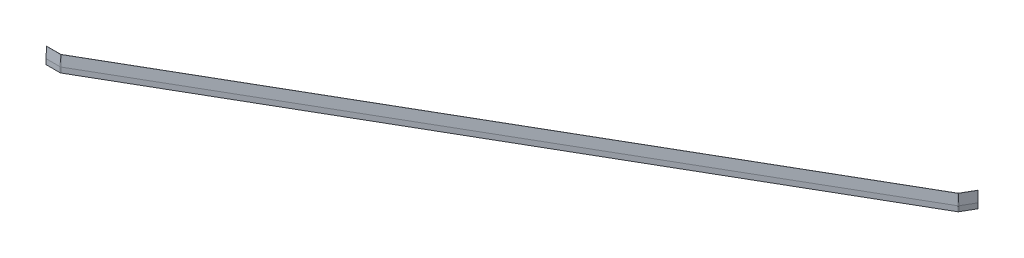
ISO-10303-21;
HEADER;
FILE_DESCRIPTION(('STEP AP214'),'2;1');
FILE_NAME('part.step','',(''),(''),'','','');
FILE_SCHEMA(('AUTOMOTIVE_DESIGN { 1 0 10303 214 1 1 1 1 }'));
ENDSEC;
DATA;
#1=APPLICATION_CONTEXT('core data for automotive mechanical design processes');
#2=APPLICATION_PROTOCOL_DEFINITION('international standard','automotive_design',2000,#1);
#3=PRODUCT_CONTEXT('',#1,'mechanical');
#4=PRODUCT('Part','Part','',(#3));
#5=PRODUCT_RELATED_PRODUCT_CATEGORY('part','',(#4));
#6=PRODUCT_DEFINITION_FORMATION('','',#4);
#7=PRODUCT_DEFINITION_CONTEXT('part definition',#1,'design');
#8=PRODUCT_DEFINITION('design','',#6,#7);
#9=PRODUCT_DEFINITION_SHAPE('','',#8);
#10=(LENGTH_UNIT() NAMED_UNIT(*) SI_UNIT(.MILLI.,.METRE.));
#11=(NAMED_UNIT(*) PLANE_ANGLE_UNIT() SI_UNIT($,.RADIAN.));
#12=(NAMED_UNIT(*) SI_UNIT($,.STERADIAN.) SOLID_ANGLE_UNIT());
#13=UNCERTAINTY_MEASURE_WITH_UNIT(LENGTH_MEASURE(1.E-05),#10,'distance_accuracy_value','');
#14=(GEOMETRIC_REPRESENTATION_CONTEXT(3) GLOBAL_UNCERTAINTY_ASSIGNED_CONTEXT((#13)) GLOBAL_UNIT_ASSIGNED_CONTEXT((#10,
#11,#12)) REPRESENTATION_CONTEXT('',''));
#15=CARTESIAN_POINT('',(0.,0.,0.));
#16=DIRECTION('',(0.,0.,1.));
#17=DIRECTION('',(1.,0.,0.));
#18=AXIS2_PLACEMENT_3D('',#15,#16,#17);
#19=CARTESIAN_POINT('',(969.539186434532,-29.9999999999976,-1289.67239500882));
#20=DIRECTION('',(0.500000000000001,0.,0.866025403784438));
#21=DIRECTION('',(0.866025403784438,0.,-0.500000000000001));
#22=AXIS2_PLACEMENT_3D('',#19,#20,#21);
#23=PLANE('',#22);
#24=DIRECTION('',(-0.866025403784438,0.,0.500000000000001));
#25=VECTOR('',#24,1.);
#26=CARTESIAN_POINT('',(969.539186434532,-29.9999999999976,-1289.67239500882));
#27=LINE('',#26,#25);
#28=CARTESIAN_POINT('',(920.944208314139,-29.9999999999977,-1261.61607130975));
#29=VERTEX_POINT('',#28);
#30=CARTESIAN_POINT('',(-1259.51264739815,-30.0000000000002,-2.72871870788949));
#31=VERTEX_POINT('',#30);
#32=EDGE_CURVE('E553',#29,#31,#27,.T.);
#33=ORIENTED_EDGE('',*,*,#32,.T.);
#34=CARTESIAN_POINT('',(-1259.51264739815,-30.0000000000002,-2.72871870788949));
#35=CARTESIAN_POINT('',(-1259.51264739815,-15.5000000000002,-2.72871870788949));
#36=B_SPLINE_CURVE_WITH_KNOTS('',1,(#34,#35),.UNSPECIFIED.,.F.,.F.,(2,2),(0.,1.),.UNSPECIFIED.);
#37=CARTESIAN_POINT('',(-1259.51264739815,-15.5000000000002,-2.72871870788949));
#38=VERTEX_POINT('',#37);
#39=EDGE_CURVE('E525',#31,#38,#36,.T.);
#40=ORIENTED_EDGE('',*,*,#39,.T.);
#41=DIRECTION('',(-0.866025403784438,0.,0.500000000000001));
#42=VECTOR('',#41,1.);
#43=CARTESIAN_POINT('',(969.539186434532,-15.4999999999976,-1289.67239500882));
#44=LINE('',#43,#42);
#45=CARTESIAN_POINT('',(920.944208314139,-15.4999999999977,-1261.61607130975));
#46=VERTEX_POINT('',#45);
#47=EDGE_CURVE('E557',#46,#38,#44,.T.);
#48=ORIENTED_EDGE('',*,*,#47,.F.);
#49=CARTESIAN_POINT('',(920.944208314139,-29.9999999999977,-1261.61607130975));
#50=CARTESIAN_POINT('',(920.944208314139,-15.4999999999977,-1261.61607130975));
#51=B_SPLINE_CURVE_WITH_KNOTS('',1,(#49,#50),.UNSPECIFIED.,.F.,.F.,(2,2),(0.,1.),.UNSPECIFIED.);
#52=EDGE_CURVE('E655',#29,#46,#51,.T.);
#53=ORIENTED_EDGE('',*,*,#52,.F.);
#54=EDGE_LOOP('',(#33,#40,#48,#53));
#55=FACE_BOUND('',#54,.T.);
#56=ADVANCED_FACE('F167',(#55),#23,.F.);
#57=CARTESIAN_POINT('',(969.439186434532,-15.4999999999976,-1289.84560008958));
#58=DIRECTION('',(0.,1.,0.));
#59=DIRECTION('',(-0.866025403784438,0.,0.500000000000001));
#60=AXIS2_PLACEMENT_3D('',#57,#58,#59);
#61=PLANE('',#60);
#62=ORIENTED_EDGE('',*,*,#47,.T.);
#63=CARTESIAN_POINT('',(-1259.51264739815,-15.5000000000002,-2.72871870788949));
#64=CARTESIAN_POINT('',(-1259.61264739815,-15.5000000000002,-2.9019237886464));
#65=B_SPLINE_CURVE_WITH_KNOTS('',1,(#63,#64),.UNSPECIFIED.,.F.,.F.,(2,2),(0.,1.),.UNSPECIFIED.);
#66=CARTESIAN_POINT('',(-1259.61264739815,-15.5000000000002,-2.9019237886464));
#67=VERTEX_POINT('',#66);
#68=EDGE_CURVE('E528',#38,#67,#65,.T.);
#69=ORIENTED_EDGE('',*,*,#68,.T.);
#70=DIRECTION('',(-0.866025403784438,0.,0.500000000000001));
#71=VECTOR('',#70,1.);
#72=CARTESIAN_POINT('',(969.439186434532,-15.4999999999976,-1289.84560008958));
#73=LINE('',#72,#71);
#74=CARTESIAN_POINT('',(920.844208314139,-15.4999999999977,-1261.7892763905));
#75=VERTEX_POINT('',#74);
#76=EDGE_CURVE('E563',#75,#67,#73,.T.);
#77=ORIENTED_EDGE('',*,*,#76,.F.);
#78=CARTESIAN_POINT('',(920.944208314139,-15.4999999999977,-1261.61607130975));
#79=CARTESIAN_POINT('',(920.844208314139,-15.4999999999977,-1261.7892763905));
#80=B_SPLINE_CURVE_WITH_KNOTS('',1,(#78,#79),.UNSPECIFIED.,.F.,.F.,(2,2),(0.,1.),.UNSPECIFIED.);
#81=EDGE_CURVE('E659',#46,#75,#80,.T.);
#82=ORIENTED_EDGE('',*,*,#81,.F.);
#83=EDGE_LOOP('',(#62,#69,#77,#82));
#84=FACE_BOUND('',#83,.T.);
#85=ADVANCED_FACE('F626',(#84),#61,.F.);
#86=CARTESIAN_POINT('',(969.439186434532,30.0000000000027,-1289.84560008958));
#87=DIRECTION('',(0.,1.,0.));
#88=DIRECTION('',(-0.866025403784438,0.,0.500000000000001));
#89=AXIS2_PLACEMENT_3D('',#86,#87,#88);
#90=PLANE('',#89);
#91=DIRECTION('',(-0.866025403784438,0.,0.500000000000001));
#92=VECTOR('',#91,1.);
#93=CARTESIAN_POINT('',(969.589186434532,30.0000000000024,-1289.58579246844));
#94=LINE('',#93,#92);
#95=CARTESIAN_POINT('',(920.994208314139,30.0000000000027,-1261.52946876937));
#96=VERTEX_POINT('',#95);
#97=CARTESIAN_POINT('',(-1259.46264739815,29.9999999999998,-2.64211616751131));
#98=VERTEX_POINT('',#97);
#99=EDGE_CURVE('E184',#96,#98,#94,.T.);
#100=ORIENTED_EDGE('',*,*,#99,.F.);
#101=CARTESIAN_POINT('',(920.994208314139,30.0000000000027,-1261.52946876937));
#102=DIRECTION('',(-0.499999999999989,0.,-0.866025403784445));
#103=VECTOR('',#102,1.);
#104=LINE('',#101,#103);
#105=CARTESIAN_POINT('',(920.844208314139,30.0000000000027,-1261.7892763905));
#106=VERTEX_POINT('',#105);
#107=EDGE_CURVE('E974',#96,#106,#104,.T.);
#108=ORIENTED_EDGE('',*,*,#107,.T.);
#109=DIRECTION('',(-0.866025403784438,0.,0.500000000000001));
#110=VECTOR('',#109,1.);
#111=CARTESIAN_POINT('',(969.439186434532,30.0000000000027,-1289.84560008958));
#112=LINE('',#111,#110);
#113=CARTESIAN_POINT('',(-1259.61264739815,29.9999999999998,-2.90192378864628));
#114=VERTEX_POINT('',#113);
#115=EDGE_CURVE('E565',#106,#114,#112,.T.);
#116=ORIENTED_EDGE('',*,*,#115,.T.);
#117=CARTESIAN_POINT('',(-1259.46264739815,29.9999999999998,-2.64211616751125));
#118=DIRECTION('',(-0.500000000000269,0.,-0.866025403784284));
#119=VECTOR('',#118,1.);
#120=LINE('',#117,#119);
#121=EDGE_CURVE('E13',#98,#114,#120,.T.);
#122=ORIENTED_EDGE('',*,*,#121,.F.);
#123=EDGE_LOOP('',(#100,#108,#116,#122));
#124=FACE_BOUND('',#123,.T.);
#125=ADVANCED_FACE('F587',(#124),#90,.T.);
#126=CARTESIAN_POINT('',(-168.134219542004,1.24553145575135E-12,-630.180536580114));
#127=DIRECTION('',(0.500000000000001,0.,0.866025403784438));
#128=DIRECTION('',(0.866025403784438,0.,-0.500000000000001));
#129=AXIS2_PLACEMENT_3D('',#126,#127,#128);
#130=PLANE('',#129);
#131=DIRECTION('',(0.866025403784438,0.,-0.500000000000001));
#132=VECTOR('',#131,1.);
#133=CARTESIAN_POINT('',(970.689186434532,-29.9999999999973,-1287.68053658011));
#134=LINE('',#133,#132);
#135=CARTESIAN_POINT('',(-1258.36264739815,-30.0000000000002,-0.736860279185736));
#136=VERTEX_POINT('',#135);
#137=CARTESIAN_POINT('',(922.094208314139,-29.9999999999973,-1259.62421288104));
#138=VERTEX_POINT('',#137);
#139=EDGE_CURVE('E600',#136,#138,#134,.T.);
#140=ORIENTED_EDGE('',*,*,#139,.T.);
#141=CARTESIAN_POINT('',(922.094208314139,-9.99999999999754,-1259.62421288104));
#142=DIRECTION('',(0.,-1.,0.));
#143=VECTOR('',#142,1.);
#144=LINE('',#141,#143);
#145=CARTESIAN_POINT('',(922.094208314139,-9.99999999999767,-1259.62421288104));
#146=VERTEX_POINT('',#145);
#147=EDGE_CURVE('E986',#146,#138,#144,.T.);
#148=ORIENTED_EDGE('',*,*,#147,.F.);
#149=DIRECTION('',(-0.866025403784438,0.,0.500000000000001));
#150=VECTOR('',#149,1.);
#151=CARTESIAN_POINT('',(970.689186434532,-9.99999999999762,-1287.68053658011));
#152=LINE('',#151,#150);
#153=CARTESIAN_POINT('',(-1258.36264739815,-10.0000000000002,-0.736860279185625));
#154=VERTEX_POINT('',#153);
#155=EDGE_CURVE('E192',#146,#154,#152,.T.);
#156=ORIENTED_EDGE('',*,*,#155,.T.);
#157=CARTESIAN_POINT('',(-1258.36264739815,-30.0000000000002,-0.736860279185858));
#158=DIRECTION('',(0.,1.,0.));
#159=VECTOR('',#158,1.);
#160=LINE('',#157,#159);
#161=EDGE_CURVE('E517',#136,#154,#160,.T.);
#162=ORIENTED_EDGE('',*,*,#161,.F.);
#163=EDGE_LOOP('',(#140,#148,#156,#162));
#164=FACE_BOUND('',#163,.T.);
#165=ADVANCED_FACE('F590',(#164),#130,.T.);
#166=CARTESIAN_POINT('',(969.439186434532,-29.9999999999973,-1289.84560008958));
#167=DIRECTION('',(0.,-1.,0.));
#168=DIRECTION('',(0.866025403784438,0.,-0.500000000000001));
#169=AXIS2_PLACEMENT_3D('',#166,#167,#168);
#170=PLANE('',#169);
#171=ORIENTED_EDGE('',*,*,#32,.F.);
#172=CARTESIAN_POINT('',(920.944208314139,-29.9999999999973,-1261.61607130975));
#173=DIRECTION('',(0.500000000000003,0.,0.866025403784437));
#174=VECTOR('',#173,1.);
#175=LINE('',#172,#174);
#176=EDGE_CURVE('E653',#29,#138,#175,.T.);
#177=ORIENTED_EDGE('',*,*,#176,.T.);
#178=ORIENTED_EDGE('',*,*,#139,.F.);
#179=CARTESIAN_POINT('',(-1259.51264739815,-30.0000000000002,-2.72871870788963));
#180=DIRECTION('',(0.500000000000199,0.,0.866025403784324));
#181=VECTOR('',#180,1.);
#182=LINE('',#179,#181);
#183=EDGE_CURVE('E452',#31,#136,#182,.T.);
#184=ORIENTED_EDGE('',*,*,#183,.F.);
#185=EDGE_LOOP('',(#171,#177,#178,#184));
#186=FACE_BOUND('',#185,.T.);
#187=ADVANCED_FACE('F617',(#186),#170,.T.);
#188=CARTESIAN_POINT('',(-169.384219542004,1.25478291714624E-12,-632.345600089575));
#189=DIRECTION('',(0.500000000000001,0.,0.866025403784438));
#190=DIRECTION('',(0.866025403784438,0.,-0.500000000000001));
#191=AXIS2_PLACEMENT_3D('',#188,#189,#190);
#192=PLANE('',#191);
#193=CARTESIAN_POINT('',(920.844208314139,-15.4999999999977,-1261.7892763905));
#194=DIRECTION('',(0.,1.,0.));
#195=VECTOR('',#194,1.);
#196=LINE('',#193,#195);
#197=EDGE_CURVE('E648',#75,#106,#196,.T.);
#198=ORIENTED_EDGE('',*,*,#197,.F.);
#199=ORIENTED_EDGE('',*,*,#76,.T.);
#200=CARTESIAN_POINT('',(-1259.61264739815,29.9999999999998,-2.90192378864659));
#201=DIRECTION('',(0.,-1.,0.));
#202=VECTOR('',#201,1.);
#203=LINE('',#200,#202);
#204=EDGE_CURVE('E465',#114,#67,#203,.T.);
#205=ORIENTED_EDGE('',*,*,#204,.F.);
#206=ORIENTED_EDGE('',*,*,#115,.F.);
#207=EDGE_LOOP('',(#198,#199,#205,#206));
#208=FACE_BOUND('',#207,.T.);
#209=ADVANCED_FACE('F585',(#208),#192,.F.);
#210=CARTESIAN_POINT('',(969.589186434532,30.0000000000024,-1289.58579246844));
#211=DIRECTION('',(-0.499245461428505,-0.0549170007571318,-0.864718504642337));
#212=DIRECTION('',(-0.0274585003785668,0.998490922857009,-0.0475595177553248));
#213=AXIS2_PLACEMENT_3D('',#210,#211,#212);
#214=PLANE('',#213);
#215=CARTESIAN_POINT('',(920.994208314139,30.0000000000027,-1261.52946876937));
#216=CARTESIAN_POINT('',(922.094208314139,-9.99999999999755,-1259.62421288104));
#217=B_SPLINE_CURVE_WITH_KNOTS('',1,(#215,#216),.UNSPECIFIED.,.F.,.F.,(2,2),(0.,1.),.UNSPECIFIED.);
#218=EDGE_CURVE('E856',#96,#146,#217,.T.);
#219=ORIENTED_EDGE('',*,*,#218,.F.);
#220=ORIENTED_EDGE('',*,*,#99,.T.);
#221=CARTESIAN_POINT('',(-1258.36264739815,-10.0000000000002,-0.736860279185762));
#222=CARTESIAN_POINT('',(-1259.46264739815,29.9999999999998,-2.64211616751136));
#223=B_SPLINE_CURVE_WITH_KNOTS('',1,(#221,#222),.UNSPECIFIED.,.F.,.F.,(2,2),(0.,1.),.UNSPECIFIED.);
#224=EDGE_CURVE('E177',#98,#154,#223,.F.);
#225=ORIENTED_EDGE('',*,*,#224,.T.);
#226=ORIENTED_EDGE('',*,*,#155,.F.);
#227=EDGE_LOOP('',(#219,#220,#225,#226));
#228=FACE_BOUND('',#227,.T.);
#229=ADVANCED_FACE('F574',(#228),#214,.F.);
#230=CARTESIAN_POINT('',(924.107348034953,-9.99999999999768,-1261.63735260186));
#231=CARTESIAN_POINT('',(922.202092146627,30.0000000000027,-1262.73735260186));
#232=CARTESIAN_POINT('',(923.870097243609,-9.99999999999766,-1261.22642217711));
#233=CARTESIAN_POINT('',(922.058102483338,30.0000000000027,-1262.48795518927));
#234=CARTESIAN_POINT('',(923.574634314613,-9.99999999999763,-1260.83960400928));
#235=CARTESIAN_POINT('',(921.880830231507,30.0000000000027,-1262.2579790628));
#236=CARTESIAN_POINT('',(922.891956906716,-9.99999999999759,-1260.15692660138));
#237=CARTESIAN_POINT('',(921.473581853198,30.0000000000027,-1261.85073068449));
#238=CARTESIAN_POINT('',(922.505138738882,-9.99999999999757,-1259.86146367239));
#239=CARTESIAN_POINT('',(921.243605726721,30.0000000000027,-1261.67345843266));
#240=CARTESIAN_POINT('',(922.094208314139,-9.99999999999755,-1259.62421288104));
#241=CARTESIAN_POINT('',(920.994208314139,30.0000000000027,-1261.52946876937));
#242=B_SPLINE_SURFACE_WITH_KNOTS('',3,1,((#230,#231),(#232,#233),(#234,#235),(#236,#237),(#238,
#239),(#240,#241)),.UNSPECIFIED.,.F.,.F.,.F.,(4,2,4),(2,2),(0.,0.5,1.),(0.,1.),.UNSPECIFIED.);
#243=CARTESIAN_POINT('',(922.094208314139,-9.99999999999755,-1259.62421288104));
#244=CARTESIAN_POINT('',(922.505138738882,-9.99999999999757,-1259.86146367239));
#245=CARTESIAN_POINT('',(922.891956906716,-9.99999999999759,-1260.15692660138));
#246=CARTESIAN_POINT('',(923.574634314613,-9.99999999999763,-1260.83960400928));
#247=CARTESIAN_POINT('',(923.870097243609,-9.99999999999766,-1261.22642217711));
#248=CARTESIAN_POINT('',(924.107348034953,-9.99999999999768,-1261.63735260186));
#249=B_SPLINE_CURVE_WITH_KNOTS('',3,(#243,#244,#245,#246,#247,#248),.UNSPECIFIED.,.F.,.F.,(4,2,
4),(0.,0.5,1.),.UNSPECIFIED.);
#250=CARTESIAN_POINT('',(924.107348034953,-9.99999999999767,-1261.63735260186));
#251=VERTEX_POINT('',#250);
#252=EDGE_CURVE('E848',#251,#146,#249,.F.);
#253=CARTESIAN_POINT('',(924.107348034953,-9.99999999999768,-1261.63735260186));
#254=CARTESIAN_POINT('',(922.202092146627,30.0000000000027,-1262.73735260186));
#255=B_SPLINE_CURVE_WITH_KNOTS('',1,(#253,#254),.UNSPECIFIED.,.F.,.F.,(2,2),(0.,1.),.UNSPECIFIED.);
#256=CARTESIAN_POINT('',(922.202092146627,30.0000000000023,-1262.73735260186));
#257=VERTEX_POINT('',#256);
#258=EDGE_CURVE('E777',#257,#251,#255,.F.);
#259=CARTESIAN_POINT('',(920.994208314139,30.0000000000027,-1261.52946876937));
#260=CARTESIAN_POINT('',(921.100572636723,30.0000000000027,-1261.59088500618));
#261=CARTESIAN_POINT('',(921.203383002164,30.0000000000027,-1261.65833045149));
#262=CARTESIAN_POINT('',(921.400751629401,30.0000000000027,-1261.80416528222));
#263=CARTESIAN_POINT('',(921.495318982561,30.0000000000027,-1261.88254235629));
#264=CARTESIAN_POINT('',(921.705138307856,30.0000000000027,-1262.07690890679));
#265=CARTESIAN_POINT('',(921.816851820869,30.0000000000027,-1262.19675277126));
#266=CARTESIAN_POINT('',(922.023772666528,30.0000000000027,-1262.45444114482));
#267=CARTESIAN_POINT('',(922.118548360238,30.0000000000027,-1262.59263215537));
#268=CARTESIAN_POINT('',(922.202092146627,30.0000000000027,-1262.73735260186));
#269=B_SPLINE_CURVE_WITH_KNOTS('',3,(#259,#260,#261,#262,#263,#264,#265,#266,#267,#268),
.UNSPECIFIED.,.F.,.F.,(4,2,2,2,4),(0.,0.368160811983159,0.735910294682204,1.22559665817585,
1.72638491581404),.UNSPECIFIED.);
#270=EDGE_CURVE('E812',#96,#257,#269,.T.);
#271=ORIENTED_EDGE('',*,*,#252,.F.);
#272=ORIENTED_EDGE('',*,*,#258,.F.);
#273=ORIENTED_EDGE('',*,*,#270,.F.);
#274=ORIENTED_EDGE('',*,*,#218,.T.);
#275=EDGE_LOOP('',(#271,#272,#273,#274));
#276=FACE_BOUND('',#275,.T.);
#277=ADVANCED_FACE('F584',(#276),#242,.F.);
#278=CARTESIAN_POINT('',(919.344208314139,67.3701117880937,-1264.38735260186));
#279=DIRECTION('',(0.,-1.,0.));
#280=DIRECTION('',(-0.500000000000001,0.,-0.866025403784438));
#281=AXIS2_PLACEMENT_3D('',#278,#279,#280);
#282=CYLINDRICAL_SURFACE('',#281,5.5);
#283=CARTESIAN_POINT('',(919.344208314139,-29.9999999999973,-1264.38735260186));
#284=DIRECTION('',(0.,1.,0.));
#285=DIRECTION('',(0.500000000000001,0.,0.866025403784438));
#286=AXIS2_PLACEMENT_3D('',#283,#284,#285);
#287=CIRCLE('',#286,5.50000000000001);
#288=CARTESIAN_POINT('',(924.107348034953,-29.9999999999973,-1261.63735260186));
#289=VERTEX_POINT('',#288);
#290=EDGE_CURVE('E836',#138,#289,#287,.T.);
#291=ORIENTED_EDGE('',*,*,#290,.T.);
#292=CARTESIAN_POINT('',(924.107348034953,-29.9999999999973,-1261.63735260186));
#293=DIRECTION('',(0.,1.,0.));
#294=VECTOR('',#293,1.);
#295=LINE('',#292,#294);
#296=EDGE_CURVE('E859',#289,#251,#295,.T.);
#297=ORIENTED_EDGE('',*,*,#296,.T.);
#298=ORIENTED_EDGE('',*,*,#252,.T.);
#299=ORIENTED_EDGE('',*,*,#147,.T.);
#300=EDGE_LOOP('',(#291,#297,#298,#299));
#301=FACE_BOUND('',#300,.T.);
#302=ADVANCED_FACE('F698',(#301),#282,.T.);
#303=CARTESIAN_POINT('',(919.344208314139,-29.9999999999973,-1264.38735260186));
#304=DIRECTION('',(0.,1.,0.));
#305=DIRECTION('',(0.500000000000001,0.,0.866025403784438));
#306=AXIS2_PLACEMENT_3D('',#303,#304,#305);
#307=PLANE('',#306);
#308=ORIENTED_EDGE('',*,*,#176,.F.);
#309=CARTESIAN_POINT('',(919.344208314139,-29.9999999999977,-1264.38735260186));
#310=DIRECTION('',(0.,-1.,0.));
#311=DIRECTION('',(-0.500000000000001,0.,-0.866025403784438));
#312=AXIS2_PLACEMENT_3D('',#309,#310,#311);
#313=CIRCLE('',#312,3.20000000000017);
#314=CARTESIAN_POINT('',(922.115489606249,-29.9999999999977,-1262.78735260186));
#315=VERTEX_POINT('',#314);
#316=EDGE_CURVE('E828',#315,#29,#313,.T.);
#317=ORIENTED_EDGE('',*,*,#316,.F.);
#318=CARTESIAN_POINT('',(922.115489606249,-29.9999999999973,-1262.78735260186));
#319=DIRECTION('',(0.866025403784404,0.,0.50000000000006));
#320=VECTOR('',#319,1.);
#321=LINE('',#318,#320);
#322=EDGE_CURVE('E378',#315,#289,#321,.T.);
#323=ORIENTED_EDGE('',*,*,#322,.T.);
#324=ORIENTED_EDGE('',*,*,#290,.F.);
#325=EDGE_LOOP('',(#308,#317,#323,#324));
#326=FACE_BOUND('',#325,.T.);
#327=ADVANCED_FACE('F687',(#326),#307,.F.);
#328=CARTESIAN_POINT('',(919.344208314139,67.3701117880937,-1264.38735260186));
#329=DIRECTION('',(0.,-1.,0.));
#330=DIRECTION('',(-0.500000000000001,0.,-0.866025403784438));
#331=AXIS2_PLACEMENT_3D('',#328,#329,#330);
#332=CYLINDRICAL_SURFACE('',#331,3.20000000000028);
#333=CARTESIAN_POINT('',(919.344208314139,-15.4999999999977,-1264.38735260186));
#334=DIRECTION('',(0.,-1.,0.));
#335=DIRECTION('',(-0.500000000000001,0.,-0.866025403784438));
#336=AXIS2_PLACEMENT_3D('',#333,#334,#335);
#337=CIRCLE('',#336,3.20000000000017);
#338=CARTESIAN_POINT('',(922.115489606249,-15.4999999999977,-1262.78735260186));
#339=VERTEX_POINT('',#338);
#340=EDGE_CURVE('E820',#339,#46,#337,.T.);
#341=ORIENTED_EDGE('',*,*,#340,.F.);
#342=CARTESIAN_POINT('',(922.115489606249,-29.9999999999977,-1262.78735260186));
#343=CARTESIAN_POINT('',(922.115489606249,-15.4999999999977,-1262.78735260186));
#344=B_SPLINE_CURVE_WITH_KNOTS('',1,(#342,#343),.UNSPECIFIED.,.F.,.F.,(2,2),(0.,1.),.UNSPECIFIED.);
#345=EDGE_CURVE('E718',#315,#339,#344,.T.);
#346=ORIENTED_EDGE('',*,*,#345,.F.);
#347=ORIENTED_EDGE('',*,*,#316,.T.);
#348=ORIENTED_EDGE('',*,*,#52,.T.);
#349=EDGE_LOOP('',(#341,#346,#347,#348));
#350=FACE_BOUND('',#349,.T.);
#351=ADVANCED_FACE('F697',(#350),#332,.F.);
#352=CARTESIAN_POINT('',(919.344208314139,-15.4999999999977,-1264.38735260186));
#353=DIRECTION('',(0.,-1.,0.));
#354=DIRECTION('',(-0.500000000000001,0.,-0.866025403784438));
#355=AXIS2_PLACEMENT_3D('',#352,#353,#354);
#356=PLANE('',#355);
#357=CARTESIAN_POINT('',(919.344208314139,-15.4999999999977,-1264.38735260186));
#358=DIRECTION('',(0.,-1.,0.));
#359=DIRECTION('',(-0.500000000000001,0.,-0.866025403784438));
#360=AXIS2_PLACEMENT_3D('',#357,#358,#359);
#361=CIRCLE('',#360,2.99999999999993);
#362=CARTESIAN_POINT('',(921.942284525492,-15.4999999999977,-1262.88735260186));
#363=VERTEX_POINT('',#362);
#364=EDGE_CURVE('E819',#363,#75,#361,.T.);
#365=ORIENTED_EDGE('',*,*,#364,.F.);
#366=CARTESIAN_POINT('',(922.115489606249,-15.4999999999977,-1262.78735260186));
#367=CARTESIAN_POINT('',(921.942284525492,-15.4999999999977,-1262.88735260186));
#368=B_SPLINE_CURVE_WITH_KNOTS('',1,(#366,#367),.UNSPECIFIED.,.F.,.F.,(2,2),(0.,1.),.UNSPECIFIED.);
#369=EDGE_CURVE('E717',#339,#363,#368,.T.);
#370=ORIENTED_EDGE('',*,*,#369,.F.);
#371=ORIENTED_EDGE('',*,*,#340,.T.);
#372=ORIENTED_EDGE('',*,*,#81,.T.);
#373=EDGE_LOOP('',(#365,#370,#371,#372));
#374=FACE_BOUND('',#373,.T.);
#375=ADVANCED_FACE('F994',(#374),#356,.T.);
#376=CARTESIAN_POINT('',(921.677660692054,30.0000000000027,-1262.05390022394));
#377=DIRECTION('',(0.,-1.,0.));
#378=DIRECTION('',(-0.500000000000001,0.,-0.866025403784438));
#379=AXIS2_PLACEMENT_3D('',#376,#377,#378);
#380=PLANE('',#379);
#381=ORIENTED_EDGE('',*,*,#107,.F.);
#382=ORIENTED_EDGE('',*,*,#270,.T.);
#383=CARTESIAN_POINT('',(922.202092146627,30.0000000000027,-1262.73735260186));
#384=DIRECTION('',(-0.866025403784926,0.,-0.499999999999156));
#385=VECTOR('',#384,1.);
#386=LINE('',#383,#385);
#387=CARTESIAN_POINT('',(921.942284525492,30.0000000000027,-1262.88735260186));
#388=VERTEX_POINT('',#387);
#389=EDGE_CURVE('E762',#257,#388,#386,.T.);
#390=ORIENTED_EDGE('',*,*,#389,.T.);
#391=CARTESIAN_POINT('',(919.344208314139,30.0000000000027,-1264.38735260186));
#392=DIRECTION('',(0.,1.,0.));
#393=DIRECTION('',(-0.500000000000001,0.,-0.866025403784438));
#394=AXIS2_PLACEMENT_3D('',#391,#392,#393);
#395=CIRCLE('',#394,2.99999999999998);
#396=EDGE_CURVE('E558',#106,#388,#395,.T.);
#397=ORIENTED_EDGE('',*,*,#396,.F.);
#398=EDGE_LOOP('',(#381,#382,#390,#397));
#399=FACE_BOUND('',#398,.T.);
#400=ADVANCED_FACE('F741',(#399),#380,.F.);
#401=CARTESIAN_POINT('',(919.344208314139,67.3701117880937,-1264.38735260186));
#402=DIRECTION('',(0.,-1.,0.));
#403=DIRECTION('',(-0.500000000000001,0.,-0.866025403784438));
#404=AXIS2_PLACEMENT_3D('',#401,#402,#403);
#405=CYLINDRICAL_SURFACE('',#404,3.);
#406=ORIENTED_EDGE('',*,*,#396,.T.);
#407=CARTESIAN_POINT('',(921.942284525492,30.0000000000027,-1262.88735260186));
#408=DIRECTION('',(0.,-1.,0.));
#409=VECTOR('',#408,1.);
#410=LINE('',#407,#409);
#411=EDGE_CURVE('E727',#388,#363,#410,.T.);
#412=ORIENTED_EDGE('',*,*,#411,.T.);
#413=ORIENTED_EDGE('',*,*,#364,.T.);
#414=ORIENTED_EDGE('',*,*,#197,.T.);
#415=EDGE_LOOP('',(#406,#412,#413,#414));
#416=FACE_BOUND('',#415,.T.);
#417=ADVANCED_FACE('F586',(#416),#405,.F.);
#418=CARTESIAN_POINT('',(948.885960826419,-29.9999999999972,-1309.55516889775));
#419=DIRECTION('',(0.499999999999998,0.,-0.86602540378444));
#420=DIRECTION('',(-0.86602540378444,0.,-0.499999999999998));
#421=AXIS2_PLACEMENT_3D('',#418,#419,#420);
#422=PLANE('',#421);
#423=DIRECTION('',(-0.86602540378444,0.,-0.499999999999998));
#424=VECTOR('',#423,1.);
#425=CARTESIAN_POINT('',(948.885960826419,-15.4999999999975,-1309.55516889775));
#426=LINE('',#425,#424);
#427=CARTESIAN_POINT('',(949.059165907176,-15.4999999999975,-1309.45516889775));
#428=VERTEX_POINT('',#427);
#429=CARTESIAN_POINT('',(948.885960826419,-15.4999999999975,-1309.55516889775));
#430=VERTEX_POINT('',#429);
#431=EDGE_CURVE('E863',#428,#430,#426,.T.);
#432=ORIENTED_EDGE('',*,*,#431,.T.);
#433=DIRECTION('',(0.,1.,0.));
#434=VECTOR('',#433,1.);
#435=CARTESIAN_POINT('',(948.885960826419,-29.9999999999972,-1309.55516889775));
#436=LINE('',#435,#434);
#437=CARTESIAN_POINT('',(948.885960826419,30.0000000000028,-1309.55516889775));
#438=VERTEX_POINT('',#437);
#439=EDGE_CURVE('E963',#430,#438,#436,.T.);
#440=ORIENTED_EDGE('',*,*,#439,.T.);
#441=DIRECTION('',(0.86602540378444,0.,0.499999999999998));
#442=VECTOR('',#441,1.);
#443=CARTESIAN_POINT('',(948.885960826419,30.0000000000028,-1309.55516889775));
#444=LINE('',#443,#442);
#445=CARTESIAN_POINT('',(949.145768447554,30.0000000000025,-1309.40516889775));
#446=VERTEX_POINT('',#445);
#447=EDGE_CURVE('E960',#438,#446,#444,.T.);
#448=ORIENTED_EDGE('',*,*,#447,.T.);
#449=DIRECTION('',(0.047559517755329,-0.998490922857009,0.0274585003785653));
#450=VECTOR('',#449,1.);
#451=CARTESIAN_POINT('',(949.145768447554,30.0000000000025,-1309.40516889775));
#452=LINE('',#451,#450);
#453=CARTESIAN_POINT('',(951.05102433588,-9.99999999999755,-1308.30516889775));
#454=VERTEX_POINT('',#453);
#455=EDGE_CURVE('E957',#446,#454,#452,.T.);
#456=ORIENTED_EDGE('',*,*,#455,.T.);
#457=DIRECTION('',(0.,1.,0.));
#458=VECTOR('',#457,1.);
#459=CARTESIAN_POINT('',(951.05102433588,-29.9999999999972,-1308.30516889775));
#460=LINE('',#459,#458);
#461=CARTESIAN_POINT('',(951.05102433588,-29.9999999999972,-1308.30516889775));
#462=VERTEX_POINT('',#461);
#463=EDGE_CURVE('E930',#462,#454,#460,.T.);
#464=ORIENTED_EDGE('',*,*,#463,.F.);
#465=DIRECTION('',(0.86602540378444,0.,0.499999999999998));
#466=VECTOR('',#465,1.);
#467=CARTESIAN_POINT('',(948.885960826419,-29.9999999999972,-1309.55516889775));
#468=LINE('',#467,#466);
#469=CARTESIAN_POINT('',(949.059165907176,-29.9999999999975,-1309.45516889775));
#470=VERTEX_POINT('',#469);
#471=EDGE_CURVE('E912',#470,#462,#468,.T.);
#472=ORIENTED_EDGE('',*,*,#471,.F.);
#473=DIRECTION('',(0.,1.,0.));
#474=VECTOR('',#473,1.);
#475=CARTESIAN_POINT('',(949.059165907176,-29.9999999999975,-1309.45516889775));
#476=LINE('',#475,#474);
#477=EDGE_CURVE('E952',#470,#428,#476,.T.);
#478=ORIENTED_EDGE('',*,*,#477,.T.);
#479=EDGE_LOOP('',(#432,#440,#448,#456,#464,#472,#478));
#480=FACE_BOUND('',#479,.T.);
#481=ADVANCED_FACE('F740',(#480),#422,.T.);
#482=CARTESIAN_POINT('',(291.385960826421,-2.92629628863287E-13,-170.731762921212));
#483=DIRECTION('',(0.86602540378444,0.,0.499999999999998));
#484=DIRECTION('',(0.499999999999998,0.,-0.86602540378444));
#485=AXIS2_PLACEMENT_3D('',#482,#483,#484);
#486=PLANE('',#485);
#487=ORIENTED_EDGE('',*,*,#439,.F.);
#488=DIRECTION('',(-0.499999999999998,0.,0.86602540378444));
#489=VECTOR('',#488,1.);
#490=CARTESIAN_POINT('',(948.885960826419,-15.4999999999975,-1309.55516889775));
#491=LINE('',#490,#489);
#492=EDGE_CURVE('E949',#430,#363,#491,.T.);
#493=ORIENTED_EDGE('',*,*,#492,.T.);
#494=ORIENTED_EDGE('',*,*,#411,.F.);
#495=DIRECTION('',(-0.499999999999998,0.,0.86602540378444));
#496=VECTOR('',#495,1.);
#497=CARTESIAN_POINT('',(948.885960826419,30.0000000000028,-1309.55516889775));
#498=LINE('',#497,#496);
#499=EDGE_CURVE('E942',#438,#388,#498,.T.);
#500=ORIENTED_EDGE('',*,*,#499,.F.);
#501=EDGE_LOOP('',(#487,#493,#494,#500));
#502=FACE_BOUND('',#501,.T.);
#503=ADVANCED_FACE('F1341',(#502),#486,.F.);
#504=CARTESIAN_POINT('',(948.885960826419,30.0000000000028,-1309.55516889775));
#505=DIRECTION('',(0.,1.,0.));
#506=DIRECTION('',(-0.499999999999998,0.,0.86602540378444));
#507=AXIS2_PLACEMENT_3D('',#504,#505,#506);
#508=PLANE('',#507);
#509=ORIENTED_EDGE('',*,*,#389,.F.);
#510=DIRECTION('',(-0.499999999999998,0.,0.86602540378444));
#511=VECTOR('',#510,1.);
#512=CARTESIAN_POINT('',(949.145768447554,30.0000000000025,-1309.40516889775));
#513=LINE('',#512,#511);
#514=EDGE_CURVE('E939',#446,#257,#513,.T.);
#515=ORIENTED_EDGE('',*,*,#514,.F.);
#516=ORIENTED_EDGE('',*,*,#447,.F.);
#517=ORIENTED_EDGE('',*,*,#499,.T.);
#518=EDGE_LOOP('',(#509,#515,#516,#517));
#519=FACE_BOUND('',#518,.T.);
#520=ADVANCED_FACE('F1330',(#519),#508,.T.);
#521=CARTESIAN_POINT('',(949.145768447554,30.0000000000025,-1309.40516889775));
#522=DIRECTION('',(-0.864718504642339,-0.0549170007571346,-0.499245461428502));
#523=DIRECTION('',(-0.047559517755329,0.998490922857009,-0.0274585003785653));
#524=AXIS2_PLACEMENT_3D('',#521,#522,#523);
#525=PLANE('',#524);
#526=ORIENTED_EDGE('',*,*,#514,.T.);
#527=ORIENTED_EDGE('',*,*,#258,.T.);
#528=DIRECTION('',(-0.499999999999998,0.,0.86602540378444));
#529=VECTOR('',#528,1.);
#530=CARTESIAN_POINT('',(951.05102433588,-9.99999999999755,-1308.30516889775));
#531=LINE('',#530,#529);
#532=EDGE_CURVE('E928',#454,#251,#531,.T.);
#533=ORIENTED_EDGE('',*,*,#532,.F.);
#534=ORIENTED_EDGE('',*,*,#455,.F.);
#535=EDGE_LOOP('',(#526,#527,#533,#534));
#536=FACE_BOUND('',#535,.T.);
#537=ADVANCED_FACE('F1321',(#536),#525,.F.);
#538=CARTESIAN_POINT('',(293.551024335882,-2.94779416528561E-13,-169.481762921212));
#539=DIRECTION('',(0.86602540378444,0.,0.499999999999998));
#540=DIRECTION('',(0.499999999999998,0.,-0.86602540378444));
#541=AXIS2_PLACEMENT_3D('',#538,#539,#540);
#542=PLANE('',#541);
#543=ORIENTED_EDGE('',*,*,#296,.F.);
#544=DIRECTION('',(0.499999999999998,0.,-0.86602540378444));
#545=VECTOR('',#544,1.);
#546=CARTESIAN_POINT('',(951.05102433588,-29.9999999999972,-1308.30516889775));
#547=LINE('',#546,#545);
#548=EDGE_CURVE('E872',#289,#462,#547,.T.);
#549=ORIENTED_EDGE('',*,*,#548,.T.);
#550=ORIENTED_EDGE('',*,*,#463,.T.);
#551=ORIENTED_EDGE('',*,*,#532,.T.);
#552=EDGE_LOOP('',(#543,#549,#550,#551));
#553=FACE_BOUND('',#552,.T.);
#554=ADVANCED_FACE('F891',(#553),#542,.T.);
#555=CARTESIAN_POINT('',(948.885960826419,-29.9999999999972,-1309.55516889775));
#556=DIRECTION('',(0.,-1.,0.));
#557=DIRECTION('',(0.499999999999998,0.,-0.86602540378444));
#558=AXIS2_PLACEMENT_3D('',#555,#556,#557);
#559=PLANE('',#558);
#560=DIRECTION('',(-0.499999999999998,0.,0.86602540378444));
#561=VECTOR('',#560,1.);
#562=CARTESIAN_POINT('',(949.059165907176,-29.9999999999975,-1309.45516889775));
#563=LINE('',#562,#561);
#564=EDGE_CURVE('E870',#470,#315,#563,.T.);
#565=ORIENTED_EDGE('',*,*,#564,.F.);
#566=ORIENTED_EDGE('',*,*,#471,.T.);
#567=ORIENTED_EDGE('',*,*,#548,.F.);
#568=ORIENTED_EDGE('',*,*,#322,.F.);
#569=EDGE_LOOP('',(#565,#566,#567,#568));
#570=FACE_BOUND('',#569,.T.);
#571=ADVANCED_FACE('F869',(#570),#559,.T.);
#572=CARTESIAN_POINT('',(949.059165907176,-29.9999999999975,-1309.45516889775));
#573=DIRECTION('',(0.86602540378444,0.,0.499999999999998));
#574=DIRECTION('',(0.499999999999998,0.,-0.86602540378444));
#575=AXIS2_PLACEMENT_3D('',#572,#573,#574);
#576=PLANE('',#575);
#577=ORIENTED_EDGE('',*,*,#564,.T.);
#578=ORIENTED_EDGE('',*,*,#345,.T.);
#579=DIRECTION('',(-0.499999999999998,0.,0.86602540378444));
#580=VECTOR('',#579,1.);
#581=CARTESIAN_POINT('',(949.059165907176,-15.4999999999975,-1309.45516889775));
#582=LINE('',#581,#580);
#583=EDGE_CURVE('E709',#428,#339,#582,.T.);
#584=ORIENTED_EDGE('',*,*,#583,.F.);
#585=ORIENTED_EDGE('',*,*,#477,.F.);
#586=EDGE_LOOP('',(#577,#578,#584,#585));
#587=FACE_BOUND('',#586,.T.);
#588=ADVANCED_FACE('F890',(#587),#576,.F.);
#589=CARTESIAN_POINT('',(948.885960826419,-15.4999999999975,-1309.55516889775));
#590=DIRECTION('',(0.,1.,0.));
#591=DIRECTION('',(-0.499999999999998,0.,0.86602540378444));
#592=AXIS2_PLACEMENT_3D('',#589,#590,#591);
#593=PLANE('',#592);
#594=ORIENTED_EDGE('',*,*,#583,.T.);
#595=ORIENTED_EDGE('',*,*,#369,.T.);
#596=ORIENTED_EDGE('',*,*,#492,.F.);
#597=ORIENTED_EDGE('',*,*,#431,.F.);
#598=EDGE_LOOP('',(#594,#595,#596,#597));
#599=FACE_BOUND('',#598,.T.);
#600=ADVANCED_FACE('F482',(#599),#593,.F.);
#601=CARTESIAN_POINT('',(-1258.36264739815,-10.0000000000002,-0.736860279185762));
#602=CARTESIAN_POINT('',(-1259.46264739815,29.9999999999998,-2.64211616751136));
#603=CARTESIAN_POINT('',(-1258.77357782289,-10.0000000000002,-0.499609487841737));
#604=CARTESIAN_POINT('',(-1259.71204481073,29.9999999999998,-2.49812650422182));
#605=CARTESIAN_POINT('',(-1259.22286530919,-10.0000000000002,-0.312346592350294));
#606=CARTESIAN_POINT('',(-1259.98055514744,29.9999999999998,-2.38759746234397));
#607=CARTESIAN_POINT('',(-1260.15541999097,-10.0000000000002,-0.0624693184700749));
#608=CARTESIAN_POINT('',(-1260.53686677786,29.9999999999998,-2.23853421023304));
#609=CARTESIAN_POINT('',(-1260.63814581546,-10.0000000000002,0.));
#610=CARTESIAN_POINT('',(-1260.82466807157,29.9999999999998,-2.19999999999995));
#611=CARTESIAN_POINT('',(-1261.11264739815,-10.0000000000002,0.));
#612=CARTESIAN_POINT('',(-1261.11264739815,29.9999999999998,-2.19999999999993));
#613=B_SPLINE_SURFACE_WITH_KNOTS('',3,1,((#601,#602),(#603,#604),(#605,#606),(#607,#608),(#609,
#610),(#611,#612)),.UNSPECIFIED.,.F.,.F.,.F.,(4,2,4),(2,2),(0.,0.5,1.),(0.,1.),.UNSPECIFIED.);
#614=CARTESIAN_POINT('',(-1261.11264739815,-10.0000000000002,0.));
#615=CARTESIAN_POINT('',(-1260.63814581546,-10.0000000000002,0.));
#616=CARTESIAN_POINT('',(-1260.15541999097,-10.0000000000002,-0.0624693184700749));
#617=CARTESIAN_POINT('',(-1259.22286530919,-10.0000000000002,-0.312346592350294));
#618=CARTESIAN_POINT('',(-1258.77357782289,-10.0000000000002,-0.499609487841737));
#619=CARTESIAN_POINT('',(-1258.36264739815,-10.0000000000002,-0.736860279185762));
#620=B_SPLINE_CURVE_WITH_KNOTS('',3,(#614,#615,#616,#617,#618,#619),.UNSPECIFIED.,.F.,.F.,(4,2,
4),(0.,0.5,1.),.UNSPECIFIED.);
#621=CARTESIAN_POINT('',(-1261.11264739815,-10.0000000000002,1.11022302462516E-13));
#622=VERTEX_POINT('',#621);
#623=EDGE_CURVE('E339',#154,#622,#620,.F.);
#624=CARTESIAN_POINT('',(-1261.11264739815,29.9999999999998,-2.19999999999993));
#625=CARTESIAN_POINT('',(-1260.98982507433,29.9999999999998,-2.20000585999186));
#626=CARTESIAN_POINT('',(-1260.86706596343,29.9999999999998,-2.20701014627557));
#627=CARTESIAN_POINT('',(-1260.62322230297,29.9999999999998,-2.234622500827));
#628=CARTESIAN_POINT('',(-1260.50213603573,29.9999999999998,-2.25521536146638));
#629=CARTESIAN_POINT('',(-1260.22324389456,29.9999999999998,-2.31863206920125));
#630=CARTESIAN_POINT('',(-1260.06657522211,29.9999999999998,-2.36656314381477));
#631=CARTESIAN_POINT('',(-1259.75853232642,29.9999999999998,-2.48626739874679));
#632=CARTESIAN_POINT('',(-1259.60735866273,29.9999999999998,-2.55855647760203));
#633=CARTESIAN_POINT('',(-1259.46264739815,29.9999999999998,-2.64211616751136));
#634=B_SPLINE_CURVE_WITH_KNOTS('',3,(#624,#625,#626,#627,#628,#629,#630,#631,#632,#633),
.UNSPECIFIED.,.F.,.F.,(4,2,2,2,4),(0.,0.368160811983154,0.735910294682084,1.2255966581757,
1.72638491581363),.UNSPECIFIED.);
#635=CARTESIAN_POINT('',(-1261.11264739815,29.9999999999998,-2.19999999999987));
#636=VERTEX_POINT('',#635);
#637=EDGE_CURVE('E395',#636,#98,#634,.T.);
#638=CARTESIAN_POINT('',(-1261.11264739815,29.9999999999998,-2.19999999999993));
#639=CARTESIAN_POINT('',(-1261.11264739815,-10.0000000000002,0.));
#640=B_SPLINE_CURVE_WITH_KNOTS('',1,(#638,#639),.UNSPECIFIED.,.F.,.F.,(2,2),(0.,1.),.UNSPECIFIED.);
#641=EDGE_CURVE('E367',#636,#622,#640,.T.);
#642=ORIENTED_EDGE('',*,*,#623,.F.);
#643=ORIENTED_EDGE('',*,*,#224,.F.);
#644=ORIENTED_EDGE('',*,*,#637,.F.);
#645=ORIENTED_EDGE('',*,*,#641,.T.);
#646=EDGE_LOOP('',(#642,#643,#644,#645));
#647=FACE_BOUND('',#646,.T.);
#648=ADVANCED_FACE('F425',(#647),#613,.F.);
#649=CARTESIAN_POINT('',(-1261.11264739815,67.3701117880907,-5.5));
#650=DIRECTION('',(0.,-1.,0.));
#651=DIRECTION('',(0.,0.,-1.));
#652=AXIS2_PLACEMENT_3D('',#649,#650,#651);
#653=CYLINDRICAL_SURFACE('',#652,5.5);
#654=CARTESIAN_POINT('',(-1261.11264739815,-30.0000000000002,-5.5));
#655=DIRECTION('',(0.,1.,0.));
#656=DIRECTION('',(0.,0.,1.));
#657=AXIS2_PLACEMENT_3D('',#654,#655,#656);
#658=CIRCLE('',#657,5.50000000000019);
#659=CARTESIAN_POINT('',(-1261.11264739815,-30.0000000000002,0.));
#660=VERTEX_POINT('',#659);
#661=EDGE_CURVE('E382',#660,#136,#658,.T.);
#662=ORIENTED_EDGE('',*,*,#661,.T.);
#663=ORIENTED_EDGE('',*,*,#161,.T.);
#664=ORIENTED_EDGE('',*,*,#623,.T.);
#665=CARTESIAN_POINT('',(-1261.11264739815,-10.0000000000002,0.));
#666=DIRECTION('',(0.,-1.,0.));
#667=VECTOR('',#666,1.);
#668=LINE('',#665,#667);
#669=EDGE_CURVE('E1027',#622,#660,#668,.T.);
#670=ORIENTED_EDGE('',*,*,#669,.T.);
#671=EDGE_LOOP('',(#662,#663,#664,#670));
#672=FACE_BOUND('',#671,.T.);
#673=ADVANCED_FACE('F414',(#672),#653,.T.);
#674=CARTESIAN_POINT('',(-1261.11264739815,-30.0000000000002,-5.5));
#675=DIRECTION('',(0.,1.,0.));
#676=DIRECTION('',(0.,0.,1.));
#677=AXIS2_PLACEMENT_3D('',#674,#675,#676);
#678=PLANE('',#677);
#679=CARTESIAN_POINT('',(-1261.11264739815,-30.0000000000002,-2.29999999999972));
#680=DIRECTION('',(0.,0.,1.));
#681=VECTOR('',#680,1.);
#682=LINE('',#679,#681);
#683=CARTESIAN_POINT('',(-1261.11264739815,-30.0000000000002,-2.29999999999972));
#684=VERTEX_POINT('',#683);
#685=EDGE_CURVE('E1030',#684,#660,#682,.T.);
#686=ORIENTED_EDGE('',*,*,#685,.F.);
#687=CARTESIAN_POINT('',(-1261.11264739815,-30.0000000000002,-5.5));
#688=DIRECTION('',(0.,-1.,0.));
#689=DIRECTION('',(0.,0.,-1.));
#690=AXIS2_PLACEMENT_3D('',#687,#688,#689);
#691=CIRCLE('',#690,3.20000000000025);
#692=EDGE_CURVE('E385',#31,#684,#691,.T.);
#693=ORIENTED_EDGE('',*,*,#692,.F.);
#694=ORIENTED_EDGE('',*,*,#183,.T.);
#695=ORIENTED_EDGE('',*,*,#661,.F.);
#696=EDGE_LOOP('',(#686,#693,#694,#695));
#697=FACE_BOUND('',#696,.T.);
#698=ADVANCED_FACE('F424',(#697),#678,.F.);
#699=CARTESIAN_POINT('',(-1261.11264739815,67.3701117880907,-5.5));
#700=DIRECTION('',(0.,-1.,0.));
#701=DIRECTION('',(0.,0.,-1.));
#702=AXIS2_PLACEMENT_3D('',#699,#700,#701);
#703=CYLINDRICAL_SURFACE('',#702,3.20000000000028);
#704=CARTESIAN_POINT('',(-1261.11264739815,-15.5000000000002,-5.5));
#705=DIRECTION('',(0.,-1.,0.));
#706=DIRECTION('',(0.,0.,-1.));
#707=AXIS2_PLACEMENT_3D('',#704,#705,#706);
#708=CIRCLE('',#707,3.20000000000019);
#709=CARTESIAN_POINT('',(-1261.11264739815,-15.5000000000002,-2.29999999999972));
#710=VERTEX_POINT('',#709);
#711=EDGE_CURVE('E390',#38,#710,#708,.T.);
#712=ORIENTED_EDGE('',*,*,#711,.F.);
#713=ORIENTED_EDGE('',*,*,#39,.F.);
#714=ORIENTED_EDGE('',*,*,#692,.T.);
#715=CARTESIAN_POINT('',(-1261.11264739815,-30.0000000000002,-2.29999999999972));
#716=CARTESIAN_POINT('',(-1261.11264739815,-15.5000000000002,-2.29999999999972));
#717=B_SPLINE_CURVE_WITH_KNOTS('',1,(#715,#716),.UNSPECIFIED.,.F.,.F.,(2,2),(0.,1.),.UNSPECIFIED.);
#718=EDGE_CURVE('E356',#684,#710,#717,.T.);
#719=ORIENTED_EDGE('',*,*,#718,.T.);
#720=EDGE_LOOP('',(#712,#713,#714,#719));
#721=FACE_BOUND('',#720,.T.);
#722=ADVANCED_FACE('F1058',(#721),#703,.F.);
#723=CARTESIAN_POINT('',(-1261.11264739815,-15.5000000000002,-5.5));
#724=DIRECTION('',(0.,-1.,0.));
#725=DIRECTION('',(1.,0.,0.));
#726=AXIS2_PLACEMENT_3D('',#723,#724,#725);
#727=PLANE('',#726);
#728=CARTESIAN_POINT('',(-1261.11264739815,-15.5000000000002,-5.5));
#729=DIRECTION('',(0.,-1.,0.));
#730=DIRECTION('',(1.,0.,0.));
#731=AXIS2_PLACEMENT_3D('',#728,#729,#730);
#732=CIRCLE('',#731,2.99999999999989);
#733=CARTESIAN_POINT('',(-1261.11264739815,-15.5000000000002,-2.49999999999996));
#734=VERTEX_POINT('',#733);
#735=EDGE_CURVE('E379',#67,#734,#732,.T.);
#736=ORIENTED_EDGE('',*,*,#735,.F.);
#737=ORIENTED_EDGE('',*,*,#68,.F.);
#738=ORIENTED_EDGE('',*,*,#711,.T.);
#739=CARTESIAN_POINT('',(-1261.11264739815,-15.5000000000002,-2.29999999999972));
#740=CARTESIAN_POINT('',(-1261.11264739815,-15.5000000000002,-2.49999999999972));
#741=B_SPLINE_CURVE_WITH_KNOTS('',1,(#739,#740),.UNSPECIFIED.,.F.,.F.,(2,2),(0.,1.),.UNSPECIFIED.);
#742=EDGE_CURVE('E349',#710,#734,#741,.T.);
#743=ORIENTED_EDGE('',*,*,#742,.T.);
#744=EDGE_LOOP('',(#736,#737,#738,#743));
#745=FACE_BOUND('',#744,.T.);
#746=ADVANCED_FACE('F489',(#745),#727,.T.);
#747=CARTESIAN_POINT('',(-1260.25854454931,29.9999999999998,-2.31244477324605));
#748=DIRECTION('',(0.,-1.,0.));
#749=DIRECTION('',(0.,0.,-1.));
#750=AXIS2_PLACEMENT_3D('',#747,#748,#749);
#751=PLANE('',#750);
#752=CARTESIAN_POINT('',(-1261.11264739815,29.9999999999998,-2.19999999999989));
#753=DIRECTION('',(0.,0.,-1.));
#754=VECTOR('',#753,1.);
#755=LINE('',#752,#754);
#756=CARTESIAN_POINT('',(-1261.11264739815,29.9999999999998,-2.49999999999995));
#757=VERTEX_POINT('',#756);
#758=EDGE_CURVE('E324',#636,#757,#755,.T.);
#759=ORIENTED_EDGE('',*,*,#758,.F.);
#760=ORIENTED_EDGE('',*,*,#637,.T.);
#761=ORIENTED_EDGE('',*,*,#121,.T.);
#762=CARTESIAN_POINT('',(-1261.11264739815,29.9999999999998,-5.5));
#763=DIRECTION('',(0.,1.,0.));
#764=DIRECTION('',(1.,0.,0.));
#765=AXIS2_PLACEMENT_3D('',#762,#763,#764);
#766=CIRCLE('',#765,2.99999999999996);
#767=EDGE_CURVE('E372',#757,#114,#766,.T.);
#768=ORIENTED_EDGE('',*,*,#767,.F.);
#769=EDGE_LOOP('',(#759,#760,#761,#768));
#770=FACE_BOUND('',#769,.T.);
#771=ADVANCED_FACE('F481',(#770),#751,.F.);
#772=CARTESIAN_POINT('',(-1261.11264739815,67.3701117880907,-5.5));
#773=DIRECTION('',(0.,-1.,0.));
#774=DIRECTION('',(0.,0.,-1.));
#775=AXIS2_PLACEMENT_3D('',#772,#773,#774);
#776=CYLINDRICAL_SURFACE('',#775,3.);
#777=ORIENTED_EDGE('',*,*,#767,.T.);
#778=ORIENTED_EDGE('',*,*,#204,.T.);
#779=ORIENTED_EDGE('',*,*,#735,.T.);
#780=CARTESIAN_POINT('',(-1261.11264739815,-15.5000000000002,-2.5));
#781=DIRECTION('',(0.,1.,0.));
#782=VECTOR('',#781,1.);
#783=LINE('',#780,#782);
#784=EDGE_CURVE('E1061',#734,#757,#783,.T.);
#785=ORIENTED_EDGE('',*,*,#784,.T.);
#786=EDGE_LOOP('',(#777,#778,#779,#785));
#787=FACE_BOUND('',#786,.T.);
#788=ADVANCED_FACE('F471',(#787),#776,.F.);
#789=CARTESIAN_POINT('',(-1315.,-30.0000000000002,-2.49999999999984));
#790=DIRECTION('',(-1.,0.,0.));
#791=DIRECTION('',(0.,0.,1.));
#792=AXIS2_PLACEMENT_3D('',#789,#790,#791);
#793=PLANE('',#792);
#794=DIRECTION('',(0.,0.,-1.));
#795=VECTOR('',#794,1.);
#796=CARTESIAN_POINT('',(-1315.,-15.5000000000002,-2.49999999999972));
#797=LINE('',#796,#795);
#798=CARTESIAN_POINT('',(-1315.,-15.5000000000002,-2.29999999999972));
#799=VERTEX_POINT('',#798);
#800=CARTESIAN_POINT('',(-1315.,-15.5000000000002,-2.49999999999972));
#801=VERTEX_POINT('',#800);
#802=EDGE_CURVE('E1042',#799,#801,#797,.T.);
#803=ORIENTED_EDGE('',*,*,#802,.F.);
#804=DIRECTION('',(0.,1.,0.));
#805=VECTOR('',#804,1.);
#806=CARTESIAN_POINT('',(-1315.,-30.0000000000002,-2.29999999999972));
#807=LINE('',#806,#805);
#808=CARTESIAN_POINT('',(-1315.,-30.0000000000002,-2.29999999999972));
#809=VERTEX_POINT('',#808);
#810=EDGE_CURVE('E1035',#809,#799,#807,.T.);
#811=ORIENTED_EDGE('',*,*,#810,.F.);
#812=DIRECTION('',(0.,0.,1.));
#813=VECTOR('',#812,1.);
#814=CARTESIAN_POINT('',(-1315.,-30.0000000000002,-2.49999999999984));
#815=LINE('',#814,#813);
#816=CARTESIAN_POINT('',(-1315.,-30.0000000000002,1.11022302462516E-13));
#817=VERTEX_POINT('',#816);
#818=EDGE_CURVE('E345',#809,#817,#815,.T.);
#819=ORIENTED_EDGE('',*,*,#818,.T.);
#820=DIRECTION('',(0.,-1.,0.));
#821=VECTOR('',#820,1.);
#822=CARTESIAN_POINT('',(-1315.,-30.0000000000002,1.11022302462516E-13));
#823=LINE('',#822,#821);
#824=CARTESIAN_POINT('',(-1315.,-10.0000000000002,1.11022302462516E-13));
#825=VERTEX_POINT('',#824);
#826=EDGE_CURVE('E1135',#825,#817,#823,.T.);
#827=ORIENTED_EDGE('',*,*,#826,.F.);
#828=DIRECTION('',(0.,-0.998490922857009,0.0549170007571355));
#829=VECTOR('',#828,1.);
#830=CARTESIAN_POINT('',(-1315.,29.9999999999998,-2.19999999999998));
#831=LINE('',#830,#829);
#832=CARTESIAN_POINT('',(-1315.,29.9999999999998,-2.19999999999998));
#833=VERTEX_POINT('',#832);
#834=EDGE_CURVE('E338',#833,#825,#831,.T.);
#835=ORIENTED_EDGE('',*,*,#834,.F.);
#836=DIRECTION('',(0.,0.,1.));
#837=VECTOR('',#836,1.);
#838=CARTESIAN_POINT('',(-1315.,29.9999999999998,-2.49999999999995));
#839=LINE('',#838,#837);
#840=CARTESIAN_POINT('',(-1315.,29.9999999999998,-2.49999999999995));
#841=VERTEX_POINT('',#840);
#842=EDGE_CURVE('E322',#841,#833,#839,.T.);
#843=ORIENTED_EDGE('',*,*,#842,.F.);
#844=DIRECTION('',(0.,-1.,0.));
#845=VECTOR('',#844,1.);
#846=CARTESIAN_POINT('',(-1315.,-30.0000000000002,-2.49999999999984));
#847=LINE('',#846,#845);
#848=EDGE_CURVE('E335',#841,#801,#847,.T.);
#849=ORIENTED_EDGE('',*,*,#848,.T.);
#850=EDGE_LOOP('',(#803,#811,#819,#827,#835,#843,#849));
#851=FACE_BOUND('',#850,.T.);
#852=ADVANCED_FACE('F334',(#851),#793,.T.);
#853=CARTESIAN_POINT('',(0.,0.,-2.50000000000006));
#854=DIRECTION('',(0.,0.,1.));
#855=DIRECTION('',(1.,0.,0.));
#856=AXIS2_PLACEMENT_3D('',#853,#854,#855);
#857=PLANE('',#856);
#858=ORIENTED_EDGE('',*,*,#784,.F.);
#859=DIRECTION('',(-1.,0.,0.));
#860=VECTOR('',#859,1.);
#861=CARTESIAN_POINT('',(1315.,-15.5000000000002,-2.49999999999972));
#862=LINE('',#861,#860);
#863=EDGE_CURVE('E344',#734,#801,#862,.T.);
#864=ORIENTED_EDGE('',*,*,#863,.T.);
#865=ORIENTED_EDGE('',*,*,#848,.F.);
#866=DIRECTION('',(-1.,0.,0.));
#867=VECTOR('',#866,1.);
#868=CARTESIAN_POINT('',(1315.,30.0000000000002,-2.49999999999995));
#869=LINE('',#868,#867);
#870=EDGE_CURVE('E319',#757,#841,#869,.T.);
#871=ORIENTED_EDGE('',*,*,#870,.F.);
#872=EDGE_LOOP('',(#858,#864,#865,#871));
#873=FACE_BOUND('',#872,.T.);
#874=ADVANCED_FACE('F342',(#873),#857,.F.);
#875=CARTESIAN_POINT('',(1315.,-15.5000000000002,-2.49999999999972));
#876=DIRECTION('',(0.,1.,0.));
#877=DIRECTION('',(-1.,0.,0.));
#878=AXIS2_PLACEMENT_3D('',#875,#876,#877);
#879=PLANE('',#878);
#880=ORIENTED_EDGE('',*,*,#742,.F.);
#881=DIRECTION('',(-1.,0.,0.));
#882=VECTOR('',#881,1.);
#883=CARTESIAN_POINT('',(1315.,-15.5000000000002,-2.29999999999972));
#884=LINE('',#883,#882);
#885=EDGE_CURVE('E347',#710,#799,#884,.T.);
#886=ORIENTED_EDGE('',*,*,#885,.T.);
#887=ORIENTED_EDGE('',*,*,#802,.T.);
#888=ORIENTED_EDGE('',*,*,#863,.F.);
#889=EDGE_LOOP('',(#880,#886,#887,#888));
#890=FACE_BOUND('',#889,.T.);
#891=ADVANCED_FACE('F1054',(#890),#879,.F.);
#892=CARTESIAN_POINT('',(1315.,-30.0000000000002,-2.29999999999972));
#893=DIRECTION('',(0.,0.,1.));
#894=DIRECTION('',(1.,0.,0.));
#895=AXIS2_PLACEMENT_3D('',#892,#893,#894);
#896=PLANE('',#895);
#897=ORIENTED_EDGE('',*,*,#718,.F.);
#898=DIRECTION('',(-1.,0.,0.));
#899=VECTOR('',#898,1.);
#900=CARTESIAN_POINT('',(1315.,-29.9999999999998,-2.29999999999972));
#901=LINE('',#900,#899);
#902=EDGE_CURVE('E1038',#684,#809,#901,.T.);
#903=ORIENTED_EDGE('',*,*,#902,.T.);
#904=ORIENTED_EDGE('',*,*,#810,.T.);
#905=ORIENTED_EDGE('',*,*,#885,.F.);
#906=EDGE_LOOP('',(#897,#903,#904,#905));
#907=FACE_BOUND('',#906,.T.);
#908=ADVANCED_FACE('F1056',(#907),#896,.F.);
#909=CARTESIAN_POINT('',(1315.,-29.9999999999998,-2.50000000000006));
#910=DIRECTION('',(0.,-1.,0.));
#911=DIRECTION('',(1.,0.,0.));
#912=AXIS2_PLACEMENT_3D('',#909,#910,#911);
#913=PLANE('',#912);
#914=ORIENTED_EDGE('',*,*,#902,.F.);
#915=ORIENTED_EDGE('',*,*,#685,.T.);
#916=DIRECTION('',(1.,0.,0.));
#917=VECTOR('',#916,1.);
#918=CARTESIAN_POINT('',(1315.,-29.9999999999998,0.));
#919=LINE('',#918,#917);
#920=EDGE_CURVE('E1034',#817,#660,#919,.T.);
#921=ORIENTED_EDGE('',*,*,#920,.F.);
#922=ORIENTED_EDGE('',*,*,#818,.F.);
#923=EDGE_LOOP('',(#914,#915,#921,#922));
#924=FACE_BOUND('',#923,.T.);
#925=ADVANCED_FACE('F1119',(#924),#913,.T.);
#926=CARTESIAN_POINT('',(0.,0.,1.11022302462516E-13));
#927=DIRECTION('',(0.,0.,1.));
#928=DIRECTION('',(1.,0.,0.));
#929=AXIS2_PLACEMENT_3D('',#926,#927,#928);
#930=PLANE('',#929);
#931=ORIENTED_EDGE('',*,*,#920,.T.);
#932=ORIENTED_EDGE('',*,*,#669,.F.);
#933=DIRECTION('',(-1.,0.,0.));
#934=VECTOR('',#933,1.);
#935=CARTESIAN_POINT('',(1315.,-10.0000000000002,-1.11022302462516E-13));
#936=LINE('',#935,#934);
#937=EDGE_CURVE('E1098',#622,#825,#936,.T.);
#938=ORIENTED_EDGE('',*,*,#937,.T.);
#939=ORIENTED_EDGE('',*,*,#826,.T.);
#940=EDGE_LOOP('',(#931,#932,#938,#939));
#941=FACE_BOUND('',#940,.T.);
#942=ADVANCED_FACE('F1115',(#941),#930,.T.);
#943=CARTESIAN_POINT('',(1315.,29.9999999999998,-2.20000000000009));
#944=DIRECTION('',(0.,-0.0549170007571355,-0.998490922857009));
#945=DIRECTION('',(0.,0.998490922857009,-0.0549170007571355));
#946=AXIS2_PLACEMENT_3D('',#943,#944,#945);
#947=PLANE('',#946);
#948=ORIENTED_EDGE('',*,*,#641,.F.);
#949=DIRECTION('',(-1.,0.,0.));
#950=VECTOR('',#949,1.);
#951=CARTESIAN_POINT('',(1315.,29.9999999999998,-2.20000000000009));
#952=LINE('',#951,#950);
#953=EDGE_CURVE('E1097',#636,#833,#952,.T.);
#954=ORIENTED_EDGE('',*,*,#953,.T.);
#955=ORIENTED_EDGE('',*,*,#834,.T.);
#956=ORIENTED_EDGE('',*,*,#937,.F.);
#957=EDGE_LOOP('',(#948,#954,#955,#956));
#958=FACE_BOUND('',#957,.T.);
#959=ADVANCED_FACE('F1096',(#958),#947,.F.);
#960=CARTESIAN_POINT('',(1315.,30.0000000000002,-2.49999999999995));
#961=DIRECTION('',(0.,1.,0.));
#962=DIRECTION('',(-1.,0.,0.));
#963=AXIS2_PLACEMENT_3D('',#960,#961,#962);
#964=PLANE('',#963);
#965=ORIENTED_EDGE('',*,*,#953,.F.);
#966=ORIENTED_EDGE('',*,*,#758,.T.);
#967=ORIENTED_EDGE('',*,*,#870,.T.);
#968=ORIENTED_EDGE('',*,*,#842,.T.);
#969=EDGE_LOOP('',(#965,#966,#967,#968));
#970=FACE_BOUND('',#969,.T.);
#971=ADVANCED_FACE('F321',(#970),#964,.T.);
#972=CLOSED_SHELL('',(#56,#85,#125,#165,#187,#209,#229,#277,#302,#327,#351,#375,#400,#417,#481,
#503,#520,#537,#554,#571,#588,#600,#648,#673,#698,#722,#746,#771,#788,#852,#874,#891,#908,#925,
#942,#959,#971));
#973=MANIFOLD_SOLID_BREP('B2',#972);
#974=ADVANCED_BREP_SHAPE_REPRESENTATION('',(#18,#973),#14);
#975=SHAPE_DEFINITION_REPRESENTATION(#9,#974);
ENDSEC;
END-ISO-10303-21;
